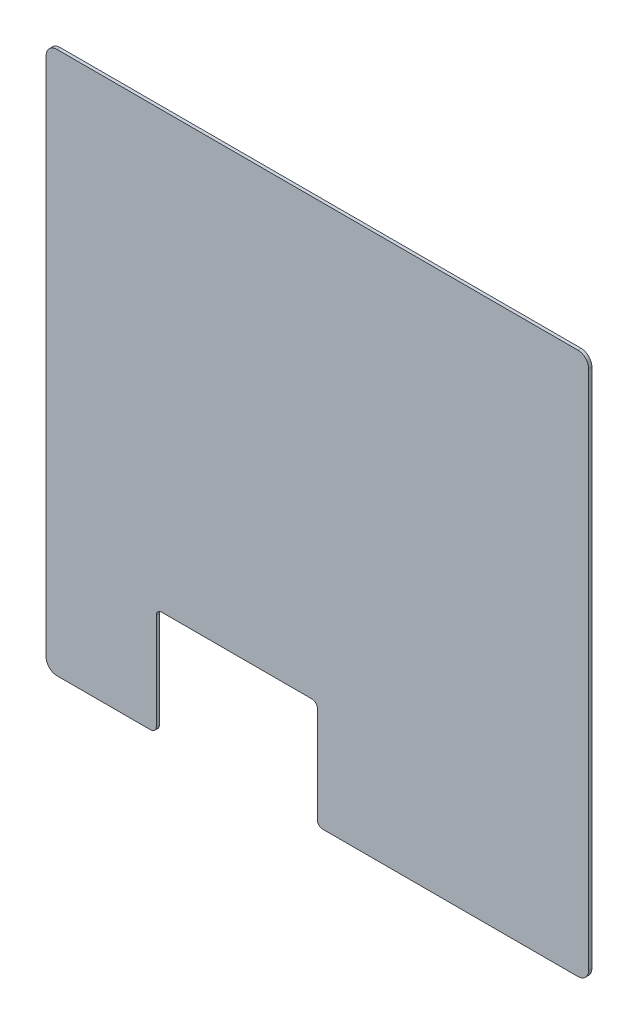
ISO-10303-21;
HEADER;
FILE_DESCRIPTION(('STEP AP214'),'2;1');
FILE_NAME('part.step','',(''),(''),'','','');
FILE_SCHEMA(('AUTOMOTIVE_DESIGN { 1 0 10303 214 1 1 1 1 }'));
ENDSEC;
DATA;
#1=APPLICATION_CONTEXT('core data for automotive mechanical design processes');
#2=APPLICATION_PROTOCOL_DEFINITION('international standard','automotive_design',2000,#1);
#3=PRODUCT_CONTEXT('',#1,'mechanical');
#4=PRODUCT('Part','Part','',(#3));
#5=PRODUCT_RELATED_PRODUCT_CATEGORY('part','',(#4));
#6=PRODUCT_DEFINITION_FORMATION('','',#4);
#7=PRODUCT_DEFINITION_CONTEXT('part definition',#1,'design');
#8=PRODUCT_DEFINITION('design','',#6,#7);
#9=PRODUCT_DEFINITION_SHAPE('','',#8);
#10=(LENGTH_UNIT() NAMED_UNIT(*) SI_UNIT(.MILLI.,.METRE.));
#11=(NAMED_UNIT(*) PLANE_ANGLE_UNIT() SI_UNIT($,.RADIAN.));
#12=(NAMED_UNIT(*) SI_UNIT($,.STERADIAN.) SOLID_ANGLE_UNIT());
#13=UNCERTAINTY_MEASURE_WITH_UNIT(LENGTH_MEASURE(1.E-05),#10,'distance_accuracy_value','');
#14=(GEOMETRIC_REPRESENTATION_CONTEXT(3) GLOBAL_UNCERTAINTY_ASSIGNED_CONTEXT((#13)) GLOBAL_UNIT_ASSIGNED_CONTEXT((#10,
#11,#12)) REPRESENTATION_CONTEXT('',''));
#15=CARTESIAN_POINT('',(0.,0.,0.));
#16=DIRECTION('',(0.,0.,1.));
#17=DIRECTION('',(1.,0.,0.));
#18=AXIS2_PLACEMENT_3D('',#15,#16,#17);
#19=CARTESIAN_POINT('',(505.,-505.,6.));
#20=DIRECTION('',(0.,1.,0.));
#21=DIRECTION('',(0.,0.,1.));
#22=AXIS2_PLACEMENT_3D('',#19,#20,#21);
#23=PLANE('',#22);
#24=DIRECTION('',(1.,0.,0.));
#25=VECTOR('',#24,1.);
#26=CARTESIAN_POINT('',(505.,-505.,0.));
#27=LINE('',#26,#25);
#28=CARTESIAN_POINT('',(-485.,-505.,0.));
#29=VERTEX_POINT('',#28);
#30=CARTESIAN_POINT('',(-310.,-505.,0.));
#31=VERTEX_POINT('',#30);
#32=EDGE_CURVE('E181',#29,#31,#27,.T.);
#33=ORIENTED_EDGE('',*,*,#32,.T.);
#34=DIRECTION('',(0.,0.,1.));
#35=VECTOR('',#34,1.);
#36=CARTESIAN_POINT('',(-310.,-505.,6.));
#37=LINE('',#36,#35);
#38=CARTESIAN_POINT('',(-310.,-505.,6.));
#39=VERTEX_POINT('',#38);
#40=EDGE_CURVE('E231',#31,#39,#37,.T.);
#41=ORIENTED_EDGE('',*,*,#40,.T.);
#42=DIRECTION('',(1.,0.,0.));
#43=VECTOR('',#42,1.);
#44=CARTESIAN_POINT('',(505.,-505.,6.));
#45=LINE('',#44,#43);
#46=CARTESIAN_POINT('',(-485.,-505.,6.));
#47=VERTEX_POINT('',#46);
#48=EDGE_CURVE('E273',#47,#39,#45,.T.);
#49=ORIENTED_EDGE('',*,*,#48,.F.);
#50=DIRECTION('',(0.,0.,-1.));
#51=VECTOR('',#50,1.);
#52=CARTESIAN_POINT('',(-485.,-505.,6.));
#53=LINE('',#52,#51);
#54=EDGE_CURVE('E209',#47,#29,#53,.T.);
#55=ORIENTED_EDGE('',*,*,#54,.T.);
#56=EDGE_LOOP('',(#33,#41,#49,#55));
#57=FACE_BOUND('',#56,.T.);
#58=ADVANCED_FACE('F33',(#57),#23,.F.);
#59=CARTESIAN_POINT('',(-505.,505.,6.));
#60=DIRECTION('',(1.,0.,0.));
#61=DIRECTION('',(0.,1.,0.));
#62=AXIS2_PLACEMENT_3D('',#59,#60,#61);
#63=PLANE('',#62);
#64=DIRECTION('',(0.,-1.,0.));
#65=VECTOR('',#64,1.);
#66=CARTESIAN_POINT('',(-505.,505.,6.));
#67=LINE('',#66,#65);
#68=CARTESIAN_POINT('',(-505.,485.,6.));
#69=VERTEX_POINT('',#68);
#70=CARTESIAN_POINT('',(-505.,-485.,6.));
#71=VERTEX_POINT('',#70);
#72=EDGE_CURVE('E175',#69,#71,#67,.T.);
#73=ORIENTED_EDGE('',*,*,#72,.F.);
#74=DIRECTION('',(0.,0.,-1.));
#75=VECTOR('',#74,1.);
#76=CARTESIAN_POINT('',(-505.,485.,6.));
#77=LINE('',#76,#75);
#78=CARTESIAN_POINT('',(-505.,485.,0.));
#79=VERTEX_POINT('',#78);
#80=EDGE_CURVE('E206',#69,#79,#77,.T.);
#81=ORIENTED_EDGE('',*,*,#80,.T.);
#82=DIRECTION('',(0.,-1.,0.));
#83=VECTOR('',#82,1.);
#84=CARTESIAN_POINT('',(-505.,505.,0.));
#85=LINE('',#84,#83);
#86=CARTESIAN_POINT('',(-505.,-485.,0.));
#87=VERTEX_POINT('',#86);
#88=EDGE_CURVE('E269',#79,#87,#85,.T.);
#89=ORIENTED_EDGE('',*,*,#88,.T.);
#90=DIRECTION('',(0.,0.,-1.));
#91=VECTOR('',#90,1.);
#92=CARTESIAN_POINT('',(-505.,-485.,6.));
#93=LINE('',#92,#91);
#94=EDGE_CURVE('E204',#87,#71,#93,.F.);
#95=ORIENTED_EDGE('',*,*,#94,.T.);
#96=EDGE_LOOP('',(#73,#81,#89,#95));
#97=FACE_BOUND('',#96,.T.);
#98=ADVANCED_FACE('F304',(#97),#63,.F.);
#99=CARTESIAN_POINT('',(10.,-505.,6.));
#100=VERTEX_POINT('',#99);
#101=CARTESIAN_POINT('',(485.,-505.,6.));
#102=VERTEX_POINT('',#101);
#103=EDGE_CURVE('E179',#100,#102,#45,.T.);
#104=ORIENTED_EDGE('',*,*,#103,.F.);
#105=DIRECTION('',(0.,0.,1.));
#106=VECTOR('',#105,1.);
#107=CARTESIAN_POINT('',(10.,-505.,6.));
#108=LINE('',#107,#106);
#109=CARTESIAN_POINT('',(10.,-505.,0.));
#110=VERTEX_POINT('',#109);
#111=EDGE_CURVE('E221',#100,#110,#108,.F.);
#112=ORIENTED_EDGE('',*,*,#111,.T.);
#113=CARTESIAN_POINT('',(485.,-505.,0.));
#114=VERTEX_POINT('',#113);
#115=EDGE_CURVE('E281',#110,#114,#27,.T.);
#116=ORIENTED_EDGE('',*,*,#115,.T.);
#117=DIRECTION('',(0.,0.,-1.));
#118=VECTOR('',#117,1.);
#119=CARTESIAN_POINT('',(485.,-505.,6.));
#120=LINE('',#119,#118);
#121=EDGE_CURVE('E201',#114,#102,#120,.F.);
#122=ORIENTED_EDGE('',*,*,#121,.T.);
#123=EDGE_LOOP('',(#104,#112,#116,#122));
#124=FACE_BOUND('',#123,.T.);
#125=ADVANCED_FACE('F286',(#124),#23,.F.);
#126=CARTESIAN_POINT('',(505.,505.,6.));
#127=DIRECTION('',(-1.,0.,0.));
#128=DIRECTION('',(0.,-1.,0.));
#129=AXIS2_PLACEMENT_3D('',#126,#127,#128);
#130=PLANE('',#129);
#131=DIRECTION('',(0.,1.,0.));
#132=VECTOR('',#131,1.);
#133=CARTESIAN_POINT('',(505.,505.,0.));
#134=LINE('',#133,#132);
#135=CARTESIAN_POINT('',(505.,-485.,0.));
#136=VERTEX_POINT('',#135);
#137=CARTESIAN_POINT('',(505.,485.,0.));
#138=VERTEX_POINT('',#137);
#139=EDGE_CURVE('E176',#136,#138,#134,.T.);
#140=ORIENTED_EDGE('',*,*,#139,.T.);
#141=DIRECTION('',(0.,0.,-1.));
#142=VECTOR('',#141,1.);
#143=CARTESIAN_POINT('',(505.,485.,6.));
#144=LINE('',#143,#142);
#145=CARTESIAN_POINT('',(505.,485.,6.));
#146=VERTEX_POINT('',#145);
#147=EDGE_CURVE('E153',#138,#146,#144,.F.);
#148=ORIENTED_EDGE('',*,*,#147,.T.);
#149=DIRECTION('',(0.,1.,0.));
#150=VECTOR('',#149,1.);
#151=CARTESIAN_POINT('',(505.,505.,6.));
#152=LINE('',#151,#150);
#153=CARTESIAN_POINT('',(505.,-485.,6.));
#154=VERTEX_POINT('',#153);
#155=EDGE_CURVE('E276',#154,#146,#152,.T.);
#156=ORIENTED_EDGE('',*,*,#155,.F.);
#157=DIRECTION('',(0.,0.,-1.));
#158=VECTOR('',#157,1.);
#159=CARTESIAN_POINT('',(505.,-485.,6.));
#160=LINE('',#159,#158);
#161=EDGE_CURVE('E157',#154,#136,#160,.T.);
#162=ORIENTED_EDGE('',*,*,#161,.T.);
#163=EDGE_LOOP('',(#140,#148,#156,#162));
#164=FACE_BOUND('',#163,.T.);
#165=ADVANCED_FACE('F296',(#164),#130,.F.);
#166=CARTESIAN_POINT('',(505.,505.,6.));
#167=DIRECTION('',(0.,-1.,0.));
#168=DIRECTION('',(1.,0.,0.));
#169=AXIS2_PLACEMENT_3D('',#166,#167,#168);
#170=PLANE('',#169);
#171=DIRECTION('',(-1.,0.,0.));
#172=VECTOR('',#171,1.);
#173=CARTESIAN_POINT('',(505.,505.,6.));
#174=LINE('',#173,#172);
#175=CARTESIAN_POINT('',(485.,505.,6.));
#176=VERTEX_POINT('',#175);
#177=CARTESIAN_POINT('',(-485.,505.,6.));
#178=VERTEX_POINT('',#177);
#179=EDGE_CURVE('E167',#176,#178,#174,.T.);
#180=ORIENTED_EDGE('',*,*,#179,.F.);
#181=DIRECTION('',(0.,0.,-1.));
#182=VECTOR('',#181,1.);
#183=CARTESIAN_POINT('',(485.,505.,6.));
#184=LINE('',#183,#182);
#185=CARTESIAN_POINT('',(485.,505.,0.));
#186=VERTEX_POINT('',#185);
#187=EDGE_CURVE('E152',#176,#186,#184,.T.);
#188=ORIENTED_EDGE('',*,*,#187,.T.);
#189=DIRECTION('',(-1.,0.,0.));
#190=VECTOR('',#189,1.);
#191=CARTESIAN_POINT('',(505.,505.,0.));
#192=LINE('',#191,#190);
#193=CARTESIAN_POINT('',(-485.,505.,0.));
#194=VERTEX_POINT('',#193);
#195=EDGE_CURVE('E164',#186,#194,#192,.T.);
#196=ORIENTED_EDGE('',*,*,#195,.T.);
#197=DIRECTION('',(0.,0.,-1.));
#198=VECTOR('',#197,1.);
#199=CARTESIAN_POINT('',(-485.,505.,6.));
#200=LINE('',#199,#198);
#201=EDGE_CURVE('E169',#194,#178,#200,.F.);
#202=ORIENTED_EDGE('',*,*,#201,.T.);
#203=EDGE_LOOP('',(#180,#188,#196,#202));
#204=FACE_BOUND('',#203,.T.);
#205=ADVANCED_FACE('F163',(#204),#170,.F.);
#206=CARTESIAN_POINT('',(0.,0.,6.));
#207=DIRECTION('',(0.,0.,-1.));
#208=DIRECTION('',(-1.,0.,0.));
#209=AXIS2_PLACEMENT_3D('',#206,#207,#208);
#210=PLANE('',#209);
#211=DIRECTION('',(0.,1.,0.));
#212=VECTOR('',#211,1.);
#213=CARTESIAN_POINT('',(0.,-505.,6.));
#214=LINE('',#213,#212);
#215=CARTESIAN_POINT('',(0.,-495.,6.));
#216=VERTEX_POINT('',#215);
#217=CARTESIAN_POINT('',(0.,-315.,6.));
#218=VERTEX_POINT('',#217);
#219=EDGE_CURVE('E258',#216,#218,#214,.T.);
#220=ORIENTED_EDGE('',*,*,#219,.F.);
#221=CARTESIAN_POINT('',(10.,-495.,6.));
#222=DIRECTION('',(0.,0.,-1.));
#223=DIRECTION('',(-1.,0.,0.));
#224=AXIS2_PLACEMENT_3D('',#221,#222,#223);
#225=CIRCLE('',#224,10.);
#226=EDGE_CURVE('E219',#216,#100,#225,.F.);
#227=ORIENTED_EDGE('',*,*,#226,.T.);
#228=ORIENTED_EDGE('',*,*,#103,.T.);
#229=CARTESIAN_POINT('',(485.,-485.,6.));
#230=DIRECTION('',(0.,0.,-1.));
#231=DIRECTION('',(-1.,0.,0.));
#232=AXIS2_PLACEMENT_3D('',#229,#230,#231);
#233=CIRCLE('',#232,20.);
#234=EDGE_CURVE('E197',#102,#154,#233,.F.);
#235=ORIENTED_EDGE('',*,*,#234,.T.);
#236=ORIENTED_EDGE('',*,*,#155,.T.);
#237=CARTESIAN_POINT('',(485.,485.,6.));
#238=DIRECTION('',(0.,0.,-1.));
#239=DIRECTION('',(-1.,0.,0.));
#240=AXIS2_PLACEMENT_3D('',#237,#238,#239);
#241=CIRCLE('',#240,20.);
#242=EDGE_CURVE('E199',#146,#176,#241,.F.);
#243=ORIENTED_EDGE('',*,*,#242,.T.);
#244=ORIENTED_EDGE('',*,*,#179,.T.);
#245=CARTESIAN_POINT('',(-485.,485.,6.));
#246=DIRECTION('',(0.,0.,-1.));
#247=DIRECTION('',(-1.,0.,0.));
#248=AXIS2_PLACEMENT_3D('',#245,#246,#247);
#249=CIRCLE('',#248,20.);
#250=EDGE_CURVE('E195',#178,#69,#249,.F.);
#251=ORIENTED_EDGE('',*,*,#250,.T.);
#252=ORIENTED_EDGE('',*,*,#72,.T.);
#253=CARTESIAN_POINT('',(-485.,-485.,6.));
#254=DIRECTION('',(0.,0.,-1.));
#255=DIRECTION('',(-1.,0.,0.));
#256=AXIS2_PLACEMENT_3D('',#253,#254,#255);
#257=CIRCLE('',#256,20.);
#258=EDGE_CURVE('E193',#71,#47,#257,.F.);
#259=ORIENTED_EDGE('',*,*,#258,.T.);
#260=ORIENTED_EDGE('',*,*,#48,.T.);
#261=CARTESIAN_POINT('',(-310.,-495.,6.));
#262=DIRECTION('',(0.,0.,-1.));
#263=DIRECTION('',(-1.,0.,0.));
#264=AXIS2_PLACEMENT_3D('',#261,#262,#263);
#265=CIRCLE('',#264,10.);
#266=CARTESIAN_POINT('',(-300.,-495.,6.));
#267=VERTEX_POINT('',#266);
#268=EDGE_CURVE('E217',#39,#267,#265,.F.);
#269=ORIENTED_EDGE('',*,*,#268,.T.);
#270=DIRECTION('',(0.,-1.,0.));
#271=VECTOR('',#270,1.);
#272=CARTESIAN_POINT('',(-300.,-505.,6.));
#273=LINE('',#272,#271);
#274=CARTESIAN_POINT('',(-300.,-315.,6.));
#275=VERTEX_POINT('',#274);
#276=EDGE_CURVE('E248',#275,#267,#273,.T.);
#277=ORIENTED_EDGE('',*,*,#276,.F.);
#278=CARTESIAN_POINT('',(-290.,-315.,6.));
#279=DIRECTION('',(0.,0.,-1.));
#280=DIRECTION('',(-1.,0.,0.));
#281=AXIS2_PLACEMENT_3D('',#278,#279,#280);
#282=CIRCLE('',#281,10.);
#283=CARTESIAN_POINT('',(-290.,-305.,6.));
#284=VERTEX_POINT('',#283);
#285=EDGE_CURVE('E41',#275,#284,#282,.T.);
#286=ORIENTED_EDGE('',*,*,#285,.T.);
#287=DIRECTION('',(-1.,0.,0.));
#288=VECTOR('',#287,1.);
#289=CARTESIAN_POINT('',(-300.,-305.,6.));
#290=LINE('',#289,#288);
#291=CARTESIAN_POINT('',(-10.,-305.,6.));
#292=VERTEX_POINT('',#291);
#293=EDGE_CURVE('E247',#292,#284,#290,.T.);
#294=ORIENTED_EDGE('',*,*,#293,.F.);
#295=CARTESIAN_POINT('',(-10.,-315.,6.));
#296=DIRECTION('',(0.,0.,-1.));
#297=DIRECTION('',(-1.,0.,0.));
#298=AXIS2_PLACEMENT_3D('',#295,#296,#297);
#299=CIRCLE('',#298,10.);
#300=EDGE_CURVE('E238',#292,#218,#299,.T.);
#301=ORIENTED_EDGE('',*,*,#300,.T.);
#302=EDGE_LOOP('',(#220,#227,#228,#235,#236,#243,#244,#251,#252,#259,#260,#269,#277,#286,#294,#301));
#303=FACE_BOUND('',#302,.T.);
#304=ADVANCED_FACE('F246',(#303),#210,.F.);
#305=CARTESIAN_POINT('',(0.,0.,0.));
#306=DIRECTION('',(0.,0.,-1.));
#307=DIRECTION('',(-1.,0.,0.));
#308=AXIS2_PLACEMENT_3D('',#305,#306,#307);
#309=PLANE('',#308);
#310=ORIENTED_EDGE('',*,*,#115,.F.);
#311=CARTESIAN_POINT('',(10.,-495.,0.));
#312=DIRECTION('',(0.,0.,-1.));
#313=DIRECTION('',(-1.,0.,0.));
#314=AXIS2_PLACEMENT_3D('',#311,#312,#313);
#315=CIRCLE('',#314,10.);
#316=CARTESIAN_POINT('',(0.,-495.,0.));
#317=VERTEX_POINT('',#316);
#318=EDGE_CURVE('E224',#110,#317,#315,.T.);
#319=ORIENTED_EDGE('',*,*,#318,.T.);
#320=DIRECTION('',(0.,1.,0.));
#321=VECTOR('',#320,1.);
#322=CARTESIAN_POINT('',(0.,-505.,0.));
#323=LINE('',#322,#321);
#324=CARTESIAN_POINT('',(0.,-315.,0.));
#325=VERTEX_POINT('',#324);
#326=EDGE_CURVE('E263',#317,#325,#323,.T.);
#327=ORIENTED_EDGE('',*,*,#326,.T.);
#328=CARTESIAN_POINT('',(-10.,-315.,0.));
#329=DIRECTION('',(0.,0.,-1.));
#330=DIRECTION('',(-1.,0.,0.));
#331=AXIS2_PLACEMENT_3D('',#328,#329,#330);
#332=CIRCLE('',#331,10.);
#333=CARTESIAN_POINT('',(-10.,-305.,0.));
#334=VERTEX_POINT('',#333);
#335=EDGE_CURVE('E240',#325,#334,#332,.F.);
#336=ORIENTED_EDGE('',*,*,#335,.T.);
#337=DIRECTION('',(-1.,0.,0.));
#338=VECTOR('',#337,1.);
#339=CARTESIAN_POINT('',(-300.,-305.,0.));
#340=LINE('',#339,#338);
#341=CARTESIAN_POINT('',(-290.,-305.,0.));
#342=VERTEX_POINT('',#341);
#343=EDGE_CURVE('E261',#334,#342,#340,.T.);
#344=ORIENTED_EDGE('',*,*,#343,.T.);
#345=CARTESIAN_POINT('',(-290.,-315.,0.));
#346=DIRECTION('',(0.,0.,-1.));
#347=DIRECTION('',(-1.,0.,0.));
#348=AXIS2_PLACEMENT_3D('',#345,#346,#347);
#349=CIRCLE('',#348,10.);
#350=CARTESIAN_POINT('',(-300.,-315.,0.));
#351=VERTEX_POINT('',#350);
#352=EDGE_CURVE('E11',#342,#351,#349,.F.);
#353=ORIENTED_EDGE('',*,*,#352,.T.);
#354=DIRECTION('',(0.,-1.,0.));
#355=VECTOR('',#354,1.);
#356=CARTESIAN_POINT('',(-300.,-505.,0.));
#357=LINE('',#356,#355);
#358=CARTESIAN_POINT('',(-300.,-495.,0.));
#359=VERTEX_POINT('',#358);
#360=EDGE_CURVE('E257',#351,#359,#357,.T.);
#361=ORIENTED_EDGE('',*,*,#360,.T.);
#362=CARTESIAN_POINT('',(-310.,-495.,0.));
#363=DIRECTION('',(0.,0.,-1.));
#364=DIRECTION('',(-1.,0.,0.));
#365=AXIS2_PLACEMENT_3D('',#362,#363,#364);
#366=CIRCLE('',#365,10.);
#367=EDGE_CURVE('E48',#359,#31,#366,.T.);
#368=ORIENTED_EDGE('',*,*,#367,.T.);
#369=ORIENTED_EDGE('',*,*,#32,.F.);
#370=CARTESIAN_POINT('',(-485.,-485.,0.));
#371=DIRECTION('',(0.,0.,-1.));
#372=DIRECTION('',(-1.,0.,0.));
#373=AXIS2_PLACEMENT_3D('',#370,#371,#372);
#374=CIRCLE('',#373,20.);
#375=EDGE_CURVE('E168',#29,#87,#374,.T.);
#376=ORIENTED_EDGE('',*,*,#375,.T.);
#377=ORIENTED_EDGE('',*,*,#88,.F.);
#378=CARTESIAN_POINT('',(-485.,485.,0.));
#379=DIRECTION('',(0.,0.,-1.));
#380=DIRECTION('',(-1.,0.,0.));
#381=AXIS2_PLACEMENT_3D('',#378,#379,#380);
#382=CIRCLE('',#381,20.);
#383=EDGE_CURVE('E174',#79,#194,#382,.T.);
#384=ORIENTED_EDGE('',*,*,#383,.T.);
#385=ORIENTED_EDGE('',*,*,#195,.F.);
#386=CARTESIAN_POINT('',(485.,485.,0.));
#387=DIRECTION('',(0.,0.,-1.));
#388=DIRECTION('',(-1.,0.,0.));
#389=AXIS2_PLACEMENT_3D('',#386,#387,#388);
#390=CIRCLE('',#389,20.);
#391=EDGE_CURVE('E148',#186,#138,#390,.T.);
#392=ORIENTED_EDGE('',*,*,#391,.T.);
#393=ORIENTED_EDGE('',*,*,#139,.F.);
#394=CARTESIAN_POINT('',(485.,-485.,0.));
#395=DIRECTION('',(0.,0.,-1.));
#396=DIRECTION('',(-1.,0.,0.));
#397=AXIS2_PLACEMENT_3D('',#394,#395,#396);
#398=CIRCLE('',#397,20.);
#399=EDGE_CURVE('E158',#136,#114,#398,.T.);
#400=ORIENTED_EDGE('',*,*,#399,.T.);
#401=EDGE_LOOP('',(#310,#319,#327,#336,#344,#353,#361,#368,#369,#376,#377,#384,#385,#392,#393,#400));
#402=FACE_BOUND('',#401,.T.);
#403=ADVANCED_FACE('F172',(#402),#309,.T.);
#404=CARTESIAN_POINT('',(-300.,-505.,0.));
#405=DIRECTION('',(-1.,0.,0.));
#406=DIRECTION('',(0.,0.,1.));
#407=AXIS2_PLACEMENT_3D('',#404,#405,#406);
#408=PLANE('',#407);
#409=ORIENTED_EDGE('',*,*,#276,.T.);
#410=DIRECTION('',(0.,0.,1.));
#411=VECTOR('',#410,1.);
#412=CARTESIAN_POINT('',(-300.,-495.,0.));
#413=LINE('',#412,#411);
#414=EDGE_CURVE('E56',#267,#359,#413,.F.);
#415=ORIENTED_EDGE('',*,*,#414,.T.);
#416=ORIENTED_EDGE('',*,*,#360,.F.);
#417=DIRECTION('',(0.,0.,1.));
#418=VECTOR('',#417,1.);
#419=CARTESIAN_POINT('',(-300.,-315.,6.));
#420=LINE('',#419,#418);
#421=EDGE_CURVE('E234',#351,#275,#420,.T.);
#422=ORIENTED_EDGE('',*,*,#421,.T.);
#423=EDGE_LOOP('',(#409,#415,#416,#422));
#424=FACE_BOUND('',#423,.T.);
#425=ADVANCED_FACE('F262',(#424),#408,.F.);
#426=CARTESIAN_POINT('',(-300.,-305.,0.));
#427=DIRECTION('',(0.,1.,0.));
#428=DIRECTION('',(0.,0.,1.));
#429=AXIS2_PLACEMENT_3D('',#426,#427,#428);
#430=PLANE('',#429);
#431=ORIENTED_EDGE('',*,*,#343,.F.);
#432=DIRECTION('',(0.,0.,1.));
#433=VECTOR('',#432,1.);
#434=CARTESIAN_POINT('',(-10.,-305.,6.));
#435=LINE('',#434,#433);
#436=EDGE_CURVE('E228',#334,#292,#435,.T.);
#437=ORIENTED_EDGE('',*,*,#436,.T.);
#438=ORIENTED_EDGE('',*,*,#293,.T.);
#439=DIRECTION('',(0.,0.,1.));
#440=VECTOR('',#439,1.);
#441=CARTESIAN_POINT('',(-290.,-305.,0.));
#442=LINE('',#441,#440);
#443=EDGE_CURVE('E226',#284,#342,#442,.F.);
#444=ORIENTED_EDGE('',*,*,#443,.T.);
#445=EDGE_LOOP('',(#431,#437,#438,#444));
#446=FACE_BOUND('',#445,.T.);
#447=ADVANCED_FACE('F254',(#446),#430,.F.);
#448=CARTESIAN_POINT('',(0.,-505.,0.));
#449=DIRECTION('',(1.,0.,0.));
#450=DIRECTION('',(0.,0.,-1.));
#451=AXIS2_PLACEMENT_3D('',#448,#449,#450);
#452=PLANE('',#451);
#453=ORIENTED_EDGE('',*,*,#326,.F.);
#454=DIRECTION('',(0.,0.,1.));
#455=VECTOR('',#454,1.);
#456=CARTESIAN_POINT('',(0.,-495.,0.));
#457=LINE('',#456,#455);
#458=EDGE_CURVE('E214',#317,#216,#457,.T.);
#459=ORIENTED_EDGE('',*,*,#458,.T.);
#460=ORIENTED_EDGE('',*,*,#219,.T.);
#461=DIRECTION('',(0.,0.,1.));
#462=VECTOR('',#461,1.);
#463=CARTESIAN_POINT('',(0.,-315.,0.));
#464=LINE('',#463,#462);
#465=EDGE_CURVE('E212',#218,#325,#464,.F.);
#466=ORIENTED_EDGE('',*,*,#465,.T.);
#467=EDGE_LOOP('',(#453,#459,#460,#466));
#468=FACE_BOUND('',#467,.T.);
#469=ADVANCED_FACE('F315',(#468),#452,.F.);
#470=CARTESIAN_POINT('',(485.,485.,6.));
#471=DIRECTION('',(0.,0.,-1.));
#472=DIRECTION('',(-1.,0.,0.));
#473=AXIS2_PLACEMENT_3D('',#470,#471,#472);
#474=CYLINDRICAL_SURFACE('',#473,20.);
#475=ORIENTED_EDGE('',*,*,#242,.F.);
#476=ORIENTED_EDGE('',*,*,#147,.F.);
#477=ORIENTED_EDGE('',*,*,#391,.F.);
#478=ORIENTED_EDGE('',*,*,#187,.F.);
#479=EDGE_LOOP('',(#475,#476,#477,#478));
#480=FACE_BOUND('',#479,.T.);
#481=ADVANCED_FACE('F151',(#480),#474,.T.);
#482=CARTESIAN_POINT('',(485.,-485.,6.));
#483=DIRECTION('',(0.,0.,-1.));
#484=DIRECTION('',(-1.,0.,0.));
#485=AXIS2_PLACEMENT_3D('',#482,#483,#484);
#486=CYLINDRICAL_SURFACE('',#485,20.);
#487=ORIENTED_EDGE('',*,*,#234,.F.);
#488=ORIENTED_EDGE('',*,*,#121,.F.);
#489=ORIENTED_EDGE('',*,*,#399,.F.);
#490=ORIENTED_EDGE('',*,*,#161,.F.);
#491=EDGE_LOOP('',(#487,#488,#489,#490));
#492=FACE_BOUND('',#491,.T.);
#493=ADVANCED_FACE('F293',(#492),#486,.T.);
#494=CARTESIAN_POINT('',(-485.,485.,6.));
#495=DIRECTION('',(0.,0.,-1.));
#496=DIRECTION('',(-1.,0.,0.));
#497=AXIS2_PLACEMENT_3D('',#494,#495,#496);
#498=CYLINDRICAL_SURFACE('',#497,20.);
#499=ORIENTED_EDGE('',*,*,#250,.F.);
#500=ORIENTED_EDGE('',*,*,#201,.F.);
#501=ORIENTED_EDGE('',*,*,#383,.F.);
#502=ORIENTED_EDGE('',*,*,#80,.F.);
#503=EDGE_LOOP('',(#499,#500,#501,#502));
#504=FACE_BOUND('',#503,.T.);
#505=ADVANCED_FACE('F318',(#504),#498,.T.);
#506=CARTESIAN_POINT('',(-485.,-485.,6.));
#507=DIRECTION('',(0.,0.,-1.));
#508=DIRECTION('',(-1.,0.,0.));
#509=AXIS2_PLACEMENT_3D('',#506,#507,#508);
#510=CYLINDRICAL_SURFACE('',#509,20.);
#511=ORIENTED_EDGE('',*,*,#258,.F.);
#512=ORIENTED_EDGE('',*,*,#94,.F.);
#513=ORIENTED_EDGE('',*,*,#375,.F.);
#514=ORIENTED_EDGE('',*,*,#54,.F.);
#515=EDGE_LOOP('',(#511,#512,#513,#514));
#516=FACE_BOUND('',#515,.T.);
#517=ADVANCED_FACE('F321',(#516),#510,.T.);
#518=CARTESIAN_POINT('',(10.,-495.,0.));
#519=DIRECTION('',(0.,0.,1.));
#520=DIRECTION('',(1.,0.,0.));
#521=AXIS2_PLACEMENT_3D('',#518,#519,#520);
#522=CYLINDRICAL_SURFACE('',#521,10.);
#523=ORIENTED_EDGE('',*,*,#318,.F.);
#524=ORIENTED_EDGE('',*,*,#111,.F.);
#525=ORIENTED_EDGE('',*,*,#226,.F.);
#526=ORIENTED_EDGE('',*,*,#458,.F.);
#527=EDGE_LOOP('',(#523,#524,#525,#526));
#528=FACE_BOUND('',#527,.T.);
#529=ADVANCED_FACE('F325',(#528),#522,.T.);
#530=CARTESIAN_POINT('',(-10.,-315.,0.));
#531=DIRECTION('',(0.,0.,-1.));
#532=DIRECTION('',(-1.,0.,0.));
#533=AXIS2_PLACEMENT_3D('',#530,#531,#532);
#534=CYLINDRICAL_SURFACE('',#533,10.);
#535=ORIENTED_EDGE('',*,*,#335,.F.);
#536=ORIENTED_EDGE('',*,*,#465,.F.);
#537=ORIENTED_EDGE('',*,*,#300,.F.);
#538=ORIENTED_EDGE('',*,*,#436,.F.);
#539=EDGE_LOOP('',(#535,#536,#537,#538));
#540=FACE_BOUND('',#539,.T.);
#541=ADVANCED_FACE('F329',(#540),#534,.F.);
#542=CARTESIAN_POINT('',(-310.,-495.,6.));
#543=DIRECTION('',(0.,0.,1.));
#544=DIRECTION('',(1.,0.,0.));
#545=AXIS2_PLACEMENT_3D('',#542,#543,#544);
#546=CYLINDRICAL_SURFACE('',#545,10.);
#547=ORIENTED_EDGE('',*,*,#367,.F.);
#548=ORIENTED_EDGE('',*,*,#414,.F.);
#549=ORIENTED_EDGE('',*,*,#268,.F.);
#550=ORIENTED_EDGE('',*,*,#40,.F.);
#551=EDGE_LOOP('',(#547,#548,#549,#550));
#552=FACE_BOUND('',#551,.T.);
#553=ADVANCED_FACE('F332',(#552),#546,.T.);
#554=CARTESIAN_POINT('',(-290.,-315.,0.));
#555=DIRECTION('',(0.,0.,-1.));
#556=DIRECTION('',(-1.,0.,0.));
#557=AXIS2_PLACEMENT_3D('',#554,#555,#556);
#558=CYLINDRICAL_SURFACE('',#557,10.);
#559=ORIENTED_EDGE('',*,*,#352,.F.);
#560=ORIENTED_EDGE('',*,*,#443,.F.);
#561=ORIENTED_EDGE('',*,*,#285,.F.);
#562=ORIENTED_EDGE('',*,*,#421,.F.);
#563=EDGE_LOOP('',(#559,#560,#561,#562));
#564=FACE_BOUND('',#563,.T.);
#565=ADVANCED_FACE('F35',(#564),#558,.F.);
#566=CLOSED_SHELL('',(#58,#98,#125,#165,#205,#304,#403,#425,#447,#469,#481,#493,#505,#517,#529,
#541,#553,#565));
#567=MANIFOLD_SOLID_BREP('B2',#566);
#568=ADVANCED_BREP_SHAPE_REPRESENTATION('',(#18,#567),#14);
#569=SHAPE_DEFINITION_REPRESENTATION(#9,#568);
ENDSEC;
END-ISO-10303-21;
